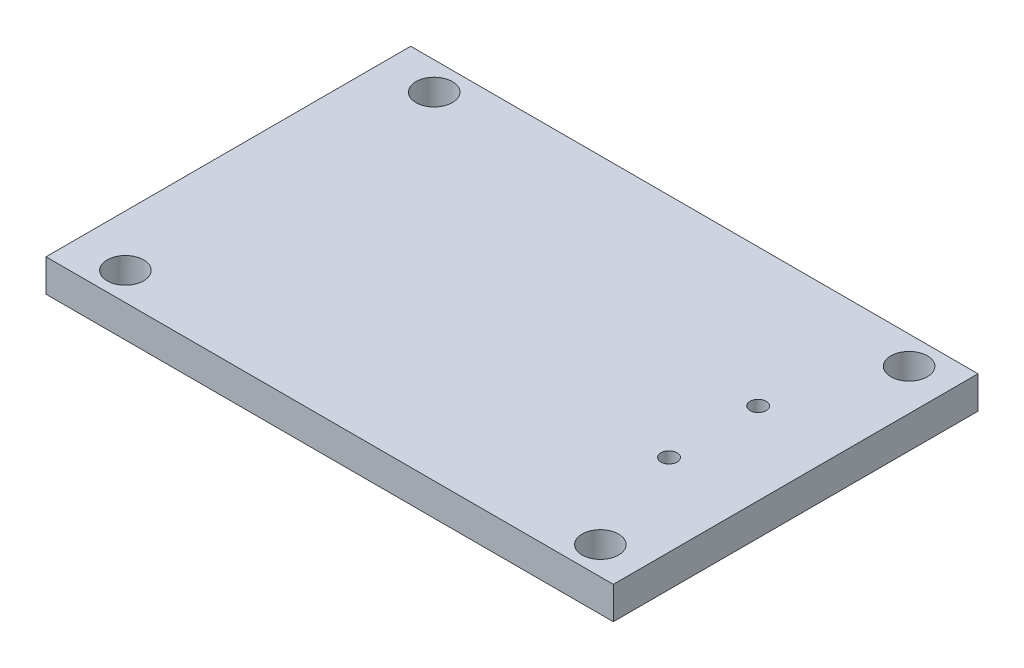
ISO-10303-21;
HEADER;
FILE_DESCRIPTION(('STEP AP214'),'2;1');
FILE_NAME('part.step','',(''),(''),'','','');
FILE_SCHEMA(('AUTOMOTIVE_DESIGN { 1 0 10303 214 1 1 1 1 }'));
ENDSEC;
DATA;
#1=APPLICATION_CONTEXT('core data for automotive mechanical design processes');
#2=APPLICATION_PROTOCOL_DEFINITION('international standard','automotive_design',2000,#1);
#3=PRODUCT_CONTEXT('',#1,'mechanical');
#4=PRODUCT('Part','Part','',(#3));
#5=PRODUCT_RELATED_PRODUCT_CATEGORY('part','',(#4));
#6=PRODUCT_DEFINITION_FORMATION('','',#4);
#7=PRODUCT_DEFINITION_CONTEXT('part definition',#1,'design');
#8=PRODUCT_DEFINITION('design','',#6,#7);
#9=PRODUCT_DEFINITION_SHAPE('','',#8);
#10=(LENGTH_UNIT() NAMED_UNIT(*) SI_UNIT(.MILLI.,.METRE.));
#11=(NAMED_UNIT(*) PLANE_ANGLE_UNIT() SI_UNIT($,.RADIAN.));
#12=(NAMED_UNIT(*) SI_UNIT($,.STERADIAN.) SOLID_ANGLE_UNIT());
#13=UNCERTAINTY_MEASURE_WITH_UNIT(LENGTH_MEASURE(1.E-05),#10,'distance_accuracy_value','');
#14=(GEOMETRIC_REPRESENTATION_CONTEXT(3) GLOBAL_UNCERTAINTY_ASSIGNED_CONTEXT((#13)) GLOBAL_UNIT_ASSIGNED_CONTEXT((#10,
#11,#12)) REPRESENTATION_CONTEXT('',''));
#15=CARTESIAN_POINT('',(0.,0.,0.));
#16=DIRECTION('',(0.,0.,1.));
#17=DIRECTION('',(1.,0.,0.));
#18=AXIS2_PLACEMENT_3D('',#15,#16,#17);
#19=CARTESIAN_POINT('',(0.,1.6,0.));
#20=DIRECTION('',(0.,1.,0.));
#21=DIRECTION('',(0.,0.,1.));
#22=AXIS2_PLACEMENT_3D('',#19,#20,#21);
#23=PLANE('',#22);
#24=CARTESIAN_POINT('',(27.73,1.6,-5.42));
#25=DIRECTION('',(0.,1.,0.));
#26=DIRECTION('',(0.,0.,1.));
#27=AXIS2_PLACEMENT_3D('',#24,#25,#26);
#28=CIRCLE('',#27,0.399999999999998);
#29=CARTESIAN_POINT('',(27.73,1.6,-5.02));
#30=VERTEX_POINT('',#29);
#31=EDGE_CURVE('E135',#30,#30,#28,.F.);
#32=ORIENTED_EDGE('',*,*,#31,.T.);
#33=EDGE_LOOP('',(#32));
#34=FACE_BOUND('',#33,.T.);
#35=CARTESIAN_POINT('',(6.32,1.6,0.));
#36=DIRECTION('',(0.,1.,0.));
#37=DIRECTION('',(0.,0.,1.));
#38=AXIS2_PLACEMENT_3D('',#35,#36,#37);
#39=CIRCLE('',#38,0.9);
#40=CARTESIAN_POINT('',(6.32,1.6,0.9));
#41=VERTEX_POINT('',#40);
#42=EDGE_CURVE('E123',#41,#41,#39,.T.);
#43=ORIENTED_EDGE('',*,*,#42,.F.);
#44=EDGE_LOOP('',(#43));
#45=FACE_BOUND('',#44,.T.);
#46=CARTESIAN_POINT('',(29.76,1.6,-15.24));
#47=DIRECTION('',(0.,1.,0.));
#48=DIRECTION('',(0.,0.,1.));
#49=AXIS2_PLACEMENT_3D('',#46,#47,#48);
#50=CIRCLE('',#49,0.899999999999997);
#51=CARTESIAN_POINT('',(29.76,1.6,-14.34));
#52=VERTEX_POINT('',#51);
#53=EDGE_CURVE('E102',#52,#52,#50,.T.);
#54=ORIENTED_EDGE('',*,*,#53,.F.);
#55=EDGE_LOOP('',(#54));
#56=FACE_BOUND('',#55,.T.);
#57=DIRECTION('',(0.,0.,1.));
#58=VECTOR('',#57,1.);
#59=CARTESIAN_POINT('',(3.78,1.6,-16.62));
#60=LINE('',#59,#58);
#61=CARTESIAN_POINT('',(3.78,1.6,-16.62));
#62=VERTEX_POINT('',#61);
#63=CARTESIAN_POINT('',(3.78,1.6,1.38));
#64=VERTEX_POINT('',#63);
#65=EDGE_CURVE('E87',#62,#64,#60,.T.);
#66=ORIENTED_EDGE('',*,*,#65,.T.);
#67=DIRECTION('',(1.,0.,0.));
#68=VECTOR('',#67,1.);
#69=CARTESIAN_POINT('',(3.78,1.6,1.38));
#70=LINE('',#69,#68);
#71=CARTESIAN_POINT('',(31.78,1.6,1.38));
#72=VERTEX_POINT('',#71);
#73=EDGE_CURVE('E82',#64,#72,#70,.T.);
#74=ORIENTED_EDGE('',*,*,#73,.T.);
#75=DIRECTION('',(0.,0.,-1.));
#76=VECTOR('',#75,1.);
#77=CARTESIAN_POINT('',(31.78,1.6,-16.62));
#78=LINE('',#77,#76);
#79=CARTESIAN_POINT('',(31.78,1.6,-16.62));
#80=VERTEX_POINT('',#79);
#81=EDGE_CURVE('E85',#72,#80,#78,.T.);
#82=ORIENTED_EDGE('',*,*,#81,.T.);
#83=DIRECTION('',(-1.,0.,0.));
#84=VECTOR('',#83,1.);
#85=CARTESIAN_POINT('',(3.78,1.6,-16.62));
#86=LINE('',#85,#84);
#87=EDGE_CURVE('E52',#80,#62,#86,.T.);
#88=ORIENTED_EDGE('',*,*,#87,.T.);
#89=EDGE_LOOP('',(#66,#74,#82,#88));
#90=FACE_BOUND('',#89,.T.);
#91=CARTESIAN_POINT('',(29.76,1.6,0.));
#92=DIRECTION('',(0.,1.,0.));
#93=DIRECTION('',(0.,0.,1.));
#94=AXIS2_PLACEMENT_3D('',#91,#92,#93);
#95=CIRCLE('',#94,0.899999999999997);
#96=CARTESIAN_POINT('',(29.76,1.6,0.899999999999997));
#97=VERTEX_POINT('',#96);
#98=EDGE_CURVE('E117',#97,#97,#95,.T.);
#99=ORIENTED_EDGE('',*,*,#98,.F.);
#100=EDGE_LOOP('',(#99));
#101=FACE_BOUND('',#100,.T.);
#102=CARTESIAN_POINT('',(6.32,1.6,-15.24));
#103=DIRECTION('',(0.,1.,0.));
#104=DIRECTION('',(0.,0.,1.));
#105=AXIS2_PLACEMENT_3D('',#102,#103,#104);
#106=CIRCLE('',#105,0.899999999999999);
#107=CARTESIAN_POINT('',(6.32,1.6,-14.34));
#108=VERTEX_POINT('',#107);
#109=EDGE_CURVE('E129',#108,#108,#106,.T.);
#110=ORIENTED_EDGE('',*,*,#109,.F.);
#111=EDGE_LOOP('',(#110));
#112=FACE_BOUND('',#111,.T.);
#113=CARTESIAN_POINT('',(27.73,1.6,-9.82));
#114=DIRECTION('',(0.,1.,0.));
#115=DIRECTION('',(0.,0.,1.));
#116=AXIS2_PLACEMENT_3D('',#113,#114,#115);
#117=CIRCLE('',#116,0.399999999999998);
#118=CARTESIAN_POINT('',(27.73,1.6,-9.42));
#119=VERTEX_POINT('',#118);
#120=EDGE_CURVE('E143',#119,#119,#117,.F.);
#121=ORIENTED_EDGE('',*,*,#120,.T.);
#122=EDGE_LOOP('',(#121));
#123=FACE_BOUND('',#122,.T.);
#124=ADVANCED_FACE('F35',(#34,#45,#56,#90,#101,#112,#123),#23,.T.);
#125=CARTESIAN_POINT('',(0.,0.,0.));
#126=DIRECTION('',(0.,1.,0.));
#127=DIRECTION('',(0.,0.,1.));
#128=AXIS2_PLACEMENT_3D('',#125,#126,#127);
#129=PLANE('',#128);
#130=DIRECTION('',(0.,0.,1.));
#131=VECTOR('',#130,1.);
#132=CARTESIAN_POINT('',(3.78,0.,-16.62));
#133=LINE('',#132,#131);
#134=CARTESIAN_POINT('',(3.78,0.,-16.62));
#135=VERTEX_POINT('',#134);
#136=CARTESIAN_POINT('',(3.78,0.,1.38));
#137=VERTEX_POINT('',#136);
#138=EDGE_CURVE('E99',#135,#137,#133,.T.);
#139=ORIENTED_EDGE('',*,*,#138,.F.);
#140=DIRECTION('',(-1.,0.,0.));
#141=VECTOR('',#140,1.);
#142=CARTESIAN_POINT('',(3.78,0.,-16.62));
#143=LINE('',#142,#141);
#144=CARTESIAN_POINT('',(31.78,0.,-16.62));
#145=VERTEX_POINT('',#144);
#146=EDGE_CURVE('E75',#145,#135,#143,.T.);
#147=ORIENTED_EDGE('',*,*,#146,.F.);
#148=DIRECTION('',(0.,0.,-1.));
#149=VECTOR('',#148,1.);
#150=CARTESIAN_POINT('',(31.78,0.,-16.62));
#151=LINE('',#150,#149);
#152=CARTESIAN_POINT('',(31.78,0.,1.38));
#153=VERTEX_POINT('',#152);
#154=EDGE_CURVE('E69',#153,#145,#151,.T.);
#155=ORIENTED_EDGE('',*,*,#154,.F.);
#156=DIRECTION('',(1.,0.,0.));
#157=VECTOR('',#156,1.);
#158=CARTESIAN_POINT('',(3.78,0.,1.38));
#159=LINE('',#158,#157);
#160=EDGE_CURVE('E91',#137,#153,#159,.T.);
#161=ORIENTED_EDGE('',*,*,#160,.F.);
#162=EDGE_LOOP('',(#139,#147,#155,#161));
#163=FACE_BOUND('',#162,.T.);
#164=CARTESIAN_POINT('',(29.76,0.,-15.24));
#165=DIRECTION('',(0.,1.,0.));
#166=DIRECTION('',(0.,0.,1.));
#167=AXIS2_PLACEMENT_3D('',#164,#165,#166);
#168=CIRCLE('',#167,0.899999999999997);
#169=CARTESIAN_POINT('',(29.76,0.,-14.34));
#170=VERTEX_POINT('',#169);
#171=EDGE_CURVE('E114',#170,#170,#168,.T.);
#172=ORIENTED_EDGE('',*,*,#171,.T.);
#173=EDGE_LOOP('',(#172));
#174=FACE_BOUND('',#173,.T.);
#175=CARTESIAN_POINT('',(29.76,0.,0.));
#176=DIRECTION('',(0.,1.,0.));
#177=DIRECTION('',(0.,0.,1.));
#178=AXIS2_PLACEMENT_3D('',#175,#176,#177);
#179=CIRCLE('',#178,0.899999999999997);
#180=CARTESIAN_POINT('',(29.76,0.,0.899999999999997));
#181=VERTEX_POINT('',#180);
#182=EDGE_CURVE('E120',#181,#181,#179,.T.);
#183=ORIENTED_EDGE('',*,*,#182,.T.);
#184=EDGE_LOOP('',(#183));
#185=FACE_BOUND('',#184,.T.);
#186=CARTESIAN_POINT('',(6.32,0.,0.));
#187=DIRECTION('',(0.,1.,0.));
#188=DIRECTION('',(0.,0.,1.));
#189=AXIS2_PLACEMENT_3D('',#186,#187,#188);
#190=CIRCLE('',#189,0.9);
#191=CARTESIAN_POINT('',(6.32,0.,0.9));
#192=VERTEX_POINT('',#191);
#193=EDGE_CURVE('E126',#192,#192,#190,.T.);
#194=ORIENTED_EDGE('',*,*,#193,.T.);
#195=EDGE_LOOP('',(#194));
#196=FACE_BOUND('',#195,.T.);
#197=CARTESIAN_POINT('',(6.32,0.,-15.24));
#198=DIRECTION('',(0.,1.,0.));
#199=DIRECTION('',(0.,0.,1.));
#200=AXIS2_PLACEMENT_3D('',#197,#198,#199);
#201=CIRCLE('',#200,0.899999999999999);
#202=CARTESIAN_POINT('',(6.32,0.,-14.34));
#203=VERTEX_POINT('',#202);
#204=EDGE_CURVE('E132',#203,#203,#201,.T.);
#205=ORIENTED_EDGE('',*,*,#204,.T.);
#206=EDGE_LOOP('',(#205));
#207=FACE_BOUND('',#206,.T.);
#208=CARTESIAN_POINT('',(27.73,0.,-5.42));
#209=DIRECTION('',(0.,1.,0.));
#210=DIRECTION('',(0.,0.,1.));
#211=AXIS2_PLACEMENT_3D('',#208,#209,#210);
#212=CIRCLE('',#211,0.399999999999998);
#213=CARTESIAN_POINT('',(27.73,0.,-5.02));
#214=VERTEX_POINT('',#213);
#215=EDGE_CURVE('E140',#214,#214,#212,.T.);
#216=ORIENTED_EDGE('',*,*,#215,.T.);
#217=EDGE_LOOP('',(#216));
#218=FACE_BOUND('',#217,.T.);
#219=CARTESIAN_POINT('',(27.73,0.,-9.82));
#220=DIRECTION('',(0.,1.,0.));
#221=DIRECTION('',(0.,0.,1.));
#222=AXIS2_PLACEMENT_3D('',#219,#220,#221);
#223=CIRCLE('',#222,0.399999999999998);
#224=CARTESIAN_POINT('',(27.73,0.,-9.42));
#225=VERTEX_POINT('',#224);
#226=EDGE_CURVE('E146',#225,#225,#223,.T.);
#227=ORIENTED_EDGE('',*,*,#226,.T.);
#228=EDGE_LOOP('',(#227));
#229=FACE_BOUND('',#228,.T.);
#230=ADVANCED_FACE('F110',(#163,#174,#185,#196,#207,#218,#229),#129,.F.);
#231=CARTESIAN_POINT('',(3.78,1.6,-16.62));
#232=DIRECTION('',(1.,0.,0.));
#233=DIRECTION('',(0.,0.,-1.));
#234=AXIS2_PLACEMENT_3D('',#231,#232,#233);
#235=PLANE('',#234);
#236=ORIENTED_EDGE('',*,*,#138,.T.);
#237=DIRECTION('',(0.,-1.,0.));
#238=VECTOR('',#237,1.);
#239=CARTESIAN_POINT('',(3.78,1.6,1.38));
#240=LINE('',#239,#238);
#241=EDGE_CURVE('E11',#64,#137,#240,.T.);
#242=ORIENTED_EDGE('',*,*,#241,.F.);
#243=ORIENTED_EDGE('',*,*,#65,.F.);
#244=DIRECTION('',(0.,-1.,0.));
#245=VECTOR('',#244,1.);
#246=CARTESIAN_POINT('',(3.78,1.6,-16.62));
#247=LINE('',#246,#245);
#248=EDGE_CURVE('E95',#62,#135,#247,.T.);
#249=ORIENTED_EDGE('',*,*,#248,.T.);
#250=EDGE_LOOP('',(#236,#242,#243,#249));
#251=FACE_BOUND('',#250,.T.);
#252=ADVANCED_FACE('F37',(#251),#235,.F.);
#253=CARTESIAN_POINT('',(3.78,1.6,1.38));
#254=DIRECTION('',(0.,0.,-1.));
#255=DIRECTION('',(-1.,0.,0.));
#256=AXIS2_PLACEMENT_3D('',#253,#254,#255);
#257=PLANE('',#256);
#258=ORIENTED_EDGE('',*,*,#160,.T.);
#259=DIRECTION('',(0.,-1.,0.));
#260=VECTOR('',#259,1.);
#261=CARTESIAN_POINT('',(31.78,1.6,1.38));
#262=LINE('',#261,#260);
#263=EDGE_CURVE('E44',#72,#153,#262,.T.);
#264=ORIENTED_EDGE('',*,*,#263,.F.);
#265=ORIENTED_EDGE('',*,*,#73,.F.);
#266=ORIENTED_EDGE('',*,*,#241,.T.);
#267=EDGE_LOOP('',(#258,#264,#265,#266));
#268=FACE_BOUND('',#267,.T.);
#269=ADVANCED_FACE('F90',(#268),#257,.F.);
#270=CARTESIAN_POINT('',(31.78,1.6,-16.62));
#271=DIRECTION('',(-1.,0.,0.));
#272=DIRECTION('',(0.,0.,1.));
#273=AXIS2_PLACEMENT_3D('',#270,#271,#272);
#274=PLANE('',#273);
#275=ORIENTED_EDGE('',*,*,#154,.T.);
#276=DIRECTION('',(0.,-1.,0.));
#277=VECTOR('',#276,1.);
#278=CARTESIAN_POINT('',(31.78,1.6,-16.62));
#279=LINE('',#278,#277);
#280=EDGE_CURVE('E92',#80,#145,#279,.T.);
#281=ORIENTED_EDGE('',*,*,#280,.F.);
#282=ORIENTED_EDGE('',*,*,#81,.F.);
#283=ORIENTED_EDGE('',*,*,#263,.T.);
#284=EDGE_LOOP('',(#275,#281,#282,#283));
#285=FACE_BOUND('',#284,.T.);
#286=ADVANCED_FACE('F93',(#285),#274,.F.);
#287=CARTESIAN_POINT('',(3.78,1.6,-16.62));
#288=DIRECTION('',(0.,0.,1.));
#289=DIRECTION('',(1.,0.,0.));
#290=AXIS2_PLACEMENT_3D('',#287,#288,#289);
#291=PLANE('',#290);
#292=ORIENTED_EDGE('',*,*,#146,.T.);
#293=ORIENTED_EDGE('',*,*,#248,.F.);
#294=ORIENTED_EDGE('',*,*,#87,.F.);
#295=ORIENTED_EDGE('',*,*,#280,.T.);
#296=EDGE_LOOP('',(#292,#293,#294,#295));
#297=FACE_BOUND('',#296,.T.);
#298=ADVANCED_FACE('F107',(#297),#291,.F.);
#299=CARTESIAN_POINT('',(29.76,1.6,-15.24));
#300=DIRECTION('',(0.,-1.,0.));
#301=DIRECTION('',(0.,0.,-1.));
#302=AXIS2_PLACEMENT_3D('',#299,#300,#301);
#303=CYLINDRICAL_SURFACE('',#302,0.899999999999997);
#304=ORIENTED_EDGE('',*,*,#53,.T.);
#305=EDGE_LOOP('',(#304));
#306=FACE_BOUND('',#305,.T.);
#307=ORIENTED_EDGE('',*,*,#171,.F.);
#308=EDGE_LOOP('',(#307));
#309=FACE_BOUND('',#308,.T.);
#310=ADVANCED_FACE('F172',(#306,#309),#303,.F.);
#311=CARTESIAN_POINT('',(29.76,1.6,0.));
#312=DIRECTION('',(0.,-1.,0.));
#313=DIRECTION('',(0.,0.,-1.));
#314=AXIS2_PLACEMENT_3D('',#311,#312,#313);
#315=CYLINDRICAL_SURFACE('',#314,0.899999999999997);
#316=ORIENTED_EDGE('',*,*,#98,.T.);
#317=EDGE_LOOP('',(#316));
#318=FACE_BOUND('',#317,.T.);
#319=ORIENTED_EDGE('',*,*,#182,.F.);
#320=EDGE_LOOP('',(#319));
#321=FACE_BOUND('',#320,.T.);
#322=ADVANCED_FACE('F215',(#318,#321),#315,.F.);
#323=CARTESIAN_POINT('',(6.32,1.6,0.));
#324=DIRECTION('',(0.,-1.,0.));
#325=DIRECTION('',(0.,0.,-1.));
#326=AXIS2_PLACEMENT_3D('',#323,#324,#325);
#327=CYLINDRICAL_SURFACE('',#326,0.9);
#328=ORIENTED_EDGE('',*,*,#42,.T.);
#329=EDGE_LOOP('',(#328));
#330=FACE_BOUND('',#329,.T.);
#331=ORIENTED_EDGE('',*,*,#193,.F.);
#332=EDGE_LOOP('',(#331));
#333=FACE_BOUND('',#332,.T.);
#334=ADVANCED_FACE('F205',(#330,#333),#327,.F.);
#335=CARTESIAN_POINT('',(6.32,1.6,-15.24));
#336=DIRECTION('',(0.,-1.,0.));
#337=DIRECTION('',(0.,0.,-1.));
#338=AXIS2_PLACEMENT_3D('',#335,#336,#337);
#339=CYLINDRICAL_SURFACE('',#338,0.899999999999999);
#340=ORIENTED_EDGE('',*,*,#109,.T.);
#341=EDGE_LOOP('',(#340));
#342=FACE_BOUND('',#341,.T.);
#343=ORIENTED_EDGE('',*,*,#204,.F.);
#344=EDGE_LOOP('',(#343));
#345=FACE_BOUND('',#344,.T.);
#346=ADVANCED_FACE('F159',(#342,#345),#339,.F.);
#347=CARTESIAN_POINT('',(27.73,10.,-5.42));
#348=DIRECTION('',(0.,-1.,0.));
#349=DIRECTION('',(0.,0.,-1.));
#350=AXIS2_PLACEMENT_3D('',#347,#348,#349);
#351=CYLINDRICAL_SURFACE('',#350,0.399999999999998);
#352=ORIENTED_EDGE('',*,*,#31,.F.);
#353=EDGE_LOOP('',(#352));
#354=FACE_BOUND('',#353,.T.);
#355=ORIENTED_EDGE('',*,*,#215,.F.);
#356=EDGE_LOOP('',(#355));
#357=FACE_BOUND('',#356,.T.);
#358=ADVANCED_FACE('F153',(#354,#357),#351,.F.);
#359=CARTESIAN_POINT('',(27.73,10.,-9.82));
#360=DIRECTION('',(0.,-1.,0.));
#361=DIRECTION('',(0.,0.,-1.));
#362=AXIS2_PLACEMENT_3D('',#359,#360,#361);
#363=CYLINDRICAL_SURFACE('',#362,0.399999999999998);
#364=ORIENTED_EDGE('',*,*,#120,.F.);
#365=EDGE_LOOP('',(#364));
#366=FACE_BOUND('',#365,.T.);
#367=ORIENTED_EDGE('',*,*,#226,.F.);
#368=EDGE_LOOP('',(#367));
#369=FACE_BOUND('',#368,.T.);
#370=ADVANCED_FACE('F151',(#366,#369),#363,.F.);
#371=CLOSED_SHELL('',(#124,#230,#252,#269,#286,#298,#310,#322,#334,#346,#358,#370));
#372=MANIFOLD_SOLID_BREP('B2',#371);
#373=ADVANCED_BREP_SHAPE_REPRESENTATION('',(#18,#372),#14);
#374=SHAPE_DEFINITION_REPRESENTATION(#9,#373);
ENDSEC;
END-ISO-10303-21;
